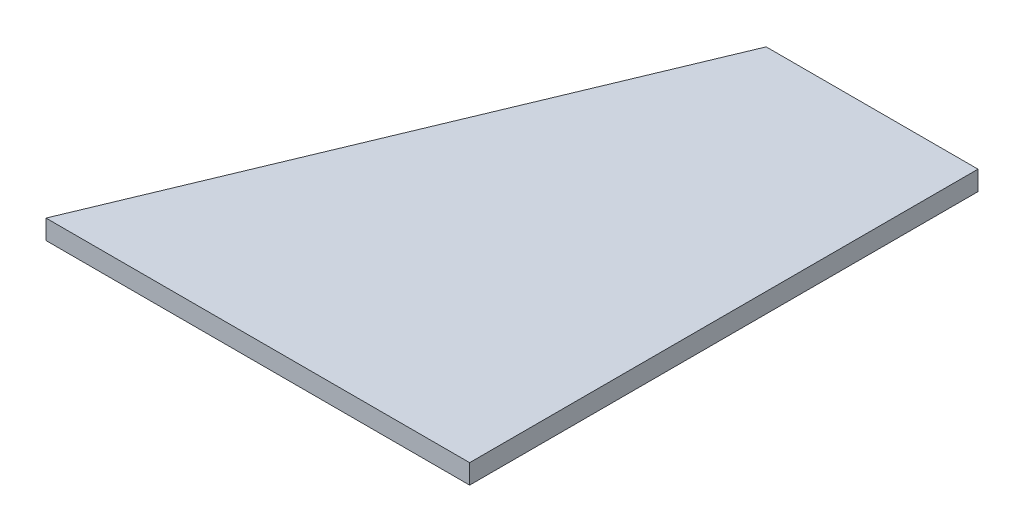
ISO-10303-21;
HEADER;
FILE_DESCRIPTION(('STEP AP214'),'2;1');
FILE_NAME('part.step','',(''),(''),'','','');
FILE_SCHEMA(('AUTOMOTIVE_DESIGN { 1 0 10303 214 1 1 1 1 }'));
ENDSEC;
DATA;
#1=APPLICATION_CONTEXT('core data for automotive mechanical design processes');
#2=APPLICATION_PROTOCOL_DEFINITION('international standard','automotive_design',2000,#1);
#3=PRODUCT_CONTEXT('',#1,'mechanical');
#4=PRODUCT('Part','Part','',(#3));
#5=PRODUCT_RELATED_PRODUCT_CATEGORY('part','',(#4));
#6=PRODUCT_DEFINITION_FORMATION('','',#4);
#7=PRODUCT_DEFINITION_CONTEXT('part definition',#1,'design');
#8=PRODUCT_DEFINITION('design','',#6,#7);
#9=PRODUCT_DEFINITION_SHAPE('','',#8);
#10=(LENGTH_UNIT() NAMED_UNIT(*) SI_UNIT(.MILLI.,.METRE.));
#11=(NAMED_UNIT(*) PLANE_ANGLE_UNIT() SI_UNIT($,.RADIAN.));
#12=(NAMED_UNIT(*) SI_UNIT($,.STERADIAN.) SOLID_ANGLE_UNIT());
#13=UNCERTAINTY_MEASURE_WITH_UNIT(LENGTH_MEASURE(1.E-05),#10,'distance_accuracy_value','');
#14=(GEOMETRIC_REPRESENTATION_CONTEXT(3) GLOBAL_UNCERTAINTY_ASSIGNED_CONTEXT((#13)) GLOBAL_UNIT_ASSIGNED_CONTEXT((#10,
#11,#12)) REPRESENTATION_CONTEXT('',''));
#15=CARTESIAN_POINT('',(0.,0.,0.));
#16=DIRECTION('',(0.,0.,1.));
#17=DIRECTION('',(1.,0.,0.));
#18=AXIS2_PLACEMENT_3D('',#15,#16,#17);
#19=CARTESIAN_POINT('',(0.,3.175,-76.2));
#20=DIRECTION('',(0.,0.,1.));
#21=DIRECTION('',(1.,0.,0.));
#22=AXIS2_PLACEMENT_3D('',#19,#20,#21);
#23=PLANE('',#22);
#24=DIRECTION('',(0.,1.,0.));
#25=VECTOR('',#24,1.);
#26=CARTESIAN_POINT('',(-31.75,0.,-76.2));
#27=LINE('',#26,#25);
#28=CARTESIAN_POINT('',(-31.75,0.,-76.2));
#29=VERTEX_POINT('',#28);
#30=CARTESIAN_POINT('',(-31.75,2.921,-76.2));
#31=VERTEX_POINT('',#30);
#32=EDGE_CURVE('E108',#29,#31,#27,.T.);
#33=ORIENTED_EDGE('',*,*,#32,.T.);
#34=DIRECTION('',(-1.,0.,0.));
#35=VECTOR('',#34,1.);
#36=CARTESIAN_POINT('',(0.,2.921,-76.2));
#37=LINE('',#36,#35);
#38=CARTESIAN_POINT('',(0.,2.921,-76.2));
#39=VERTEX_POINT('',#38);
#40=EDGE_CURVE('E146',#39,#31,#37,.T.);
#41=ORIENTED_EDGE('',*,*,#40,.F.);
#42=DIRECTION('',(0.,-1.,0.));
#43=VECTOR('',#42,1.);
#44=CARTESIAN_POINT('',(0.,3.175,-76.2));
#45=LINE('',#44,#43);
#46=CARTESIAN_POINT('',(0.,0.,-76.2));
#47=VERTEX_POINT('',#46);
#48=EDGE_CURVE('E13',#39,#47,#45,.T.);
#49=ORIENTED_EDGE('',*,*,#48,.T.);
#50=DIRECTION('',(-1.,0.,0.));
#51=VECTOR('',#50,1.);
#52=CARTESIAN_POINT('',(0.,0.,-76.2));
#53=LINE('',#52,#51);
#54=EDGE_CURVE('E123',#47,#29,#53,.T.);
#55=ORIENTED_EDGE('',*,*,#54,.T.);
#56=EDGE_LOOP('',(#33,#41,#49,#55));
#57=FACE_BOUND('',#56,.T.);
#58=ADVANCED_FACE('F68',(#57),#23,.F.);
#59=CARTESIAN_POINT('',(0.,3.175,0.));
#60=DIRECTION('',(0.,0.,-1.));
#61=DIRECTION('',(-1.,0.,0.));
#62=AXIS2_PLACEMENT_3D('',#59,#60,#61);
#63=PLANE('',#62);
#64=DIRECTION('',(0.,1.,0.));
#65=VECTOR('',#64,1.);
#66=CARTESIAN_POINT('',(-63.5,0.,0.));
#67=LINE('',#66,#65);
#68=CARTESIAN_POINT('',(-63.5,0.,0.));
#69=VERTEX_POINT('',#68);
#70=CARTESIAN_POINT('',(-63.5,2.921,0.));
#71=VERTEX_POINT('',#70);
#72=EDGE_CURVE('E84',#69,#71,#67,.T.);
#73=ORIENTED_EDGE('',*,*,#72,.F.);
#74=DIRECTION('',(1.,0.,0.));
#75=VECTOR('',#74,1.);
#76=CARTESIAN_POINT('',(0.,0.,0.));
#77=LINE('',#76,#75);
#78=CARTESIAN_POINT('',(0.,0.,0.));
#79=VERTEX_POINT('',#78);
#80=EDGE_CURVE('E91',#69,#79,#77,.T.);
#81=ORIENTED_EDGE('',*,*,#80,.T.);
#82=DIRECTION('',(0.,-1.,0.));
#83=VECTOR('',#82,1.);
#84=CARTESIAN_POINT('',(0.,3.175,0.));
#85=LINE('',#84,#83);
#86=CARTESIAN_POINT('',(0.,2.921,0.));
#87=VERTEX_POINT('',#86);
#88=EDGE_CURVE('E77',#87,#79,#85,.T.);
#89=ORIENTED_EDGE('',*,*,#88,.F.);
#90=DIRECTION('',(1.,0.,0.));
#91=VECTOR('',#90,1.);
#92=CARTESIAN_POINT('',(-63.5,2.921,0.));
#93=LINE('',#92,#91);
#94=EDGE_CURVE('E134',#71,#87,#93,.T.);
#95=ORIENTED_EDGE('',*,*,#94,.F.);
#96=EDGE_LOOP('',(#73,#81,#89,#95));
#97=FACE_BOUND('',#96,.T.);
#98=ADVANCED_FACE('F142',(#97),#63,.F.);
#99=CARTESIAN_POINT('',(0.,0.,0.));
#100=DIRECTION('',(0.,1.,0.));
#101=DIRECTION('',(0.,0.,1.));
#102=AXIS2_PLACEMENT_3D('',#99,#100,#101);
#103=PLANE('',#102);
#104=DIRECTION('',(-0.384615384615385,0.,0.923076923076923));
#105=VECTOR('',#104,1.);
#106=CARTESIAN_POINT('',(-54.1065088757396,0.,-22.5443786982249));
#107=LINE('',#106,#105);
#108=EDGE_CURVE('E111',#29,#69,#107,.T.);
#109=ORIENTED_EDGE('',*,*,#108,.F.);
#110=ORIENTED_EDGE('',*,*,#54,.F.);
#111=DIRECTION('',(0.,0.,-1.));
#112=VECTOR('',#111,1.);
#113=CARTESIAN_POINT('',(0.,0.,0.));
#114=LINE('',#113,#112);
#115=EDGE_CURVE('E129',#79,#47,#114,.T.);
#116=ORIENTED_EDGE('',*,*,#115,.F.);
#117=ORIENTED_EDGE('',*,*,#80,.F.);
#118=EDGE_LOOP('',(#109,#110,#116,#117));
#119=FACE_BOUND('',#118,.T.);
#120=ADVANCED_FACE('F121',(#119),#103,.F.);
#121=CARTESIAN_POINT('',(0.,3.175,0.));
#122=DIRECTION('',(-1.,0.,0.));
#123=DIRECTION('',(0.,0.,1.));
#124=AXIS2_PLACEMENT_3D('',#121,#122,#123);
#125=PLANE('',#124);
#126=DIRECTION('',(0.,0.,-1.));
#127=VECTOR('',#126,1.);
#128=CARTESIAN_POINT('',(0.,2.921,0.));
#129=LINE('',#128,#127);
#130=EDGE_CURVE('E140',#87,#39,#129,.T.);
#131=ORIENTED_EDGE('',*,*,#130,.F.);
#132=ORIENTED_EDGE('',*,*,#88,.T.);
#133=ORIENTED_EDGE('',*,*,#115,.T.);
#134=ORIENTED_EDGE('',*,*,#48,.F.);
#135=EDGE_LOOP('',(#131,#132,#133,#134));
#136=FACE_BOUND('',#135,.T.);
#137=ADVANCED_FACE('F70',(#136),#125,.F.);
#138=CARTESIAN_POINT('',(0.,2.921,0.));
#139=DIRECTION('',(0.,1.,0.));
#140=DIRECTION('',(0.,0.,1.));
#141=AXIS2_PLACEMENT_3D('',#138,#139,#140);
#142=PLANE('',#141);
#143=ORIENTED_EDGE('',*,*,#94,.T.);
#144=ORIENTED_EDGE('',*,*,#130,.T.);
#145=ORIENTED_EDGE('',*,*,#40,.T.);
#146=DIRECTION('',(-0.384615384615385,0.,0.923076923076923));
#147=VECTOR('',#146,1.);
#148=CARTESIAN_POINT('',(-31.75,2.921,-76.2));
#149=LINE('',#148,#147);
#150=EDGE_CURVE('E112',#31,#71,#149,.T.);
#151=ORIENTED_EDGE('',*,*,#150,.T.);
#152=EDGE_LOOP('',(#143,#144,#145,#151));
#153=FACE_BOUND('',#152,.T.);
#154=ADVANCED_FACE('F154',(#153),#142,.T.);
#155=CARTESIAN_POINT('',(-54.1065088757396,0.,-22.5443786982249));
#156=DIRECTION('',(-0.923076923076923,0.,-0.384615384615385));
#157=DIRECTION('',(-0.384615384615385,0.,0.923076923076923));
#158=AXIS2_PLACEMENT_3D('',#155,#156,#157);
#159=PLANE('',#158);
#160=ORIENTED_EDGE('',*,*,#32,.F.);
#161=ORIENTED_EDGE('',*,*,#108,.T.);
#162=ORIENTED_EDGE('',*,*,#72,.T.);
#163=ORIENTED_EDGE('',*,*,#150,.F.);
#164=EDGE_LOOP('',(#160,#161,#162,#163));
#165=FACE_BOUND('',#164,.T.);
#166=ADVANCED_FACE('F110',(#165),#159,.T.);
#167=CLOSED_SHELL('',(#58,#98,#120,#137,#154,#166));
#168=MANIFOLD_SOLID_BREP('B2',#167);
#169=ADVANCED_BREP_SHAPE_REPRESENTATION('',(#18,#168),#14);
#170=SHAPE_DEFINITION_REPRESENTATION(#9,#169);
ENDSEC;
END-ISO-10303-21;
